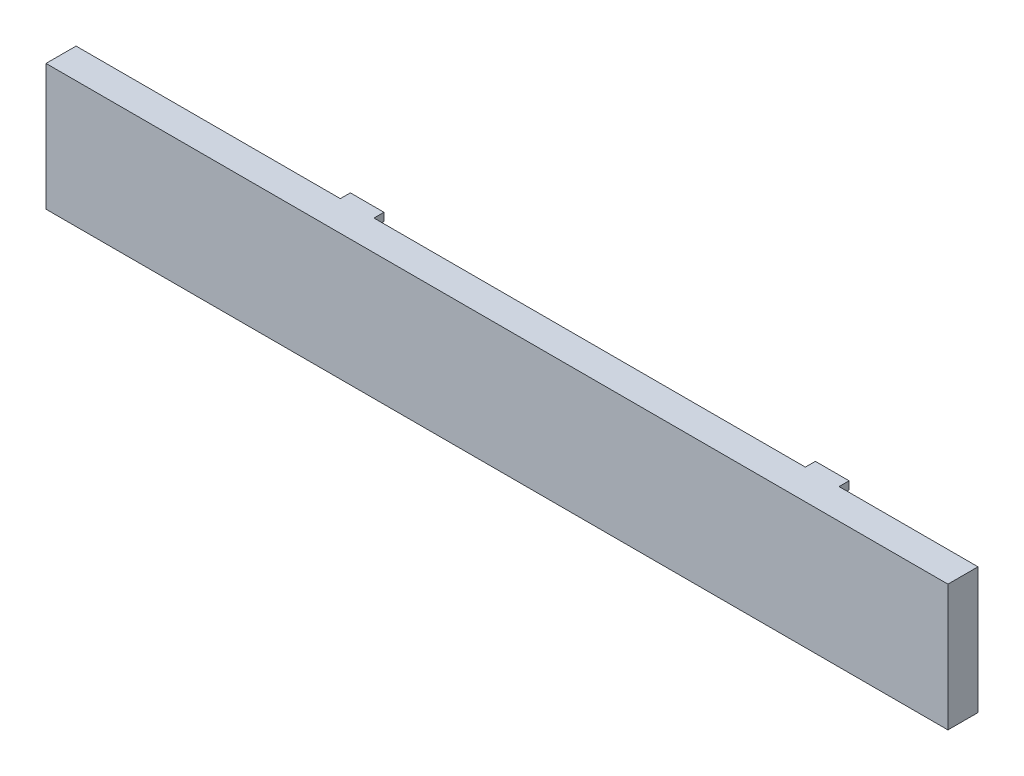
ISO-10303-21;
HEADER;
FILE_DESCRIPTION(('STEP AP214'),'2;1');
FILE_NAME('part.step','',(''),(''),'','','');
FILE_SCHEMA(('AUTOMOTIVE_DESIGN { 1 0 10303 214 1 1 1 1 }'));
ENDSEC;
DATA;
#1=APPLICATION_CONTEXT('core data for automotive mechanical design processes');
#2=APPLICATION_PROTOCOL_DEFINITION('international standard','automotive_design',2000,#1);
#3=PRODUCT_CONTEXT('',#1,'mechanical');
#4=PRODUCT('Part','Part','',(#3));
#5=PRODUCT_RELATED_PRODUCT_CATEGORY('part','',(#4));
#6=PRODUCT_DEFINITION_FORMATION('','',#4);
#7=PRODUCT_DEFINITION_CONTEXT('part definition',#1,'design');
#8=PRODUCT_DEFINITION('design','',#6,#7);
#9=PRODUCT_DEFINITION_SHAPE('','',#8);
#10=(LENGTH_UNIT() NAMED_UNIT(*) SI_UNIT(.MILLI.,.METRE.));
#11=(NAMED_UNIT(*) PLANE_ANGLE_UNIT() SI_UNIT($,.RADIAN.));
#12=(NAMED_UNIT(*) SI_UNIT($,.STERADIAN.) SOLID_ANGLE_UNIT());
#13=UNCERTAINTY_MEASURE_WITH_UNIT(LENGTH_MEASURE(1.E-05),#10,'distance_accuracy_value','');
#14=(GEOMETRIC_REPRESENTATION_CONTEXT(3) GLOBAL_UNCERTAINTY_ASSIGNED_CONTEXT((#13)) GLOBAL_UNIT_ASSIGNED_CONTEXT((#10,
#11,#12)) REPRESENTATION_CONTEXT('',''));
#15=CARTESIAN_POINT('',(0.,0.,0.));
#16=DIRECTION('',(0.,0.,1.));
#17=DIRECTION('',(1.,0.,0.));
#18=AXIS2_PLACEMENT_3D('',#15,#16,#17);
#19=CARTESIAN_POINT('',(0.,0.,0.));
#20=DIRECTION('',(0.,0.,1.));
#21=DIRECTION('',(1.,0.,0.));
#22=AXIS2_PLACEMENT_3D('',#19,#20,#21);
#23=PLANE('',#22);
#24=DIRECTION('',(1.,0.,0.));
#25=VECTOR('',#24,1.);
#26=CARTESIAN_POINT('',(-1271.22015915119,793.432360742705,0.));
#27=LINE('',#26,#25);
#28=CARTESIAN_POINT('',(-1139.37154650016,793.432360742705,0.));
#29=VERTEX_POINT('',#28);
#30=CARTESIAN_POINT('',(-1122.5980626486,793.432360742705,0.));
#31=VERTEX_POINT('',#30);
#32=EDGE_CURVE('E233',#29,#31,#27,.T.);
#33=ORIENTED_EDGE('',*,*,#32,.F.);
#34=DIRECTION('',(0.,-1.,0.));
#35=VECTOR('',#34,1.);
#36=CARTESIAN_POINT('',(-1139.37154650016,856.432360742705,0.));
#37=LINE('',#36,#35);
#38=CARTESIAN_POINT('',(-1139.37154650016,797.432360742705,0.));
#39=VERTEX_POINT('',#38);
#40=EDGE_CURVE('E224',#39,#29,#37,.T.);
#41=ORIENTED_EDGE('',*,*,#40,.F.);
#42=DIRECTION('',(1.,0.,0.));
#43=VECTOR('',#42,1.);
#44=CARTESIAN_POINT('',(0.,797.432360742705,0.));
#45=LINE('',#44,#43);
#46=CARTESIAN_POINT('',(-1122.5980626486,797.432360742705,0.));
#47=VERTEX_POINT('',#46);
#48=EDGE_CURVE('E290',#39,#47,#45,.T.);
#49=ORIENTED_EDGE('',*,*,#48,.T.);
#50=DIRECTION('',(0.,-1.,0.));
#51=VECTOR('',#50,1.);
#52=CARTESIAN_POINT('',(-1122.5980626486,856.432360742705,0.));
#53=LINE('',#52,#51);
#54=EDGE_CURVE('E439',#47,#31,#53,.T.);
#55=ORIENTED_EDGE('',*,*,#54,.T.);
#56=EDGE_LOOP('',(#33,#41,#49,#55));
#57=FACE_BOUND('',#56,.T.);
#58=ADVANCED_FACE('F42',(#57),#23,.F.);
#59=DIRECTION('',(-1.,0.,0.));
#60=VECTOR('',#59,1.);
#61=CARTESIAN_POINT('',(0.,852.432360742705,0.));
#62=LINE('',#61,#60);
#63=CARTESIAN_POINT('',(-1122.5980626486,852.432360742705,0.));
#64=VERTEX_POINT('',#63);
#65=CARTESIAN_POINT('',(-1139.37154650016,852.432360742705,0.));
#66=VERTEX_POINT('',#65);
#67=EDGE_CURVE('E221',#64,#66,#62,.T.);
#68=ORIENTED_EDGE('',*,*,#67,.T.);
#69=CARTESIAN_POINT('',(-1139.37154650016,856.432360742705,0.));
#70=VERTEX_POINT('',#69);
#71=EDGE_CURVE('E58',#70,#66,#37,.T.);
#72=ORIENTED_EDGE('',*,*,#71,.F.);
#73=DIRECTION('',(-1.,0.,0.));
#74=VECTOR('',#73,1.);
#75=CARTESIAN_POINT('',(-1271.22015915119,856.432360742705,0.));
#76=LINE('',#75,#74);
#77=CARTESIAN_POINT('',(-1122.5980626486,856.432360742705,0.));
#78=VERTEX_POINT('',#77);
#79=EDGE_CURVE('E219',#78,#70,#76,.T.);
#80=ORIENTED_EDGE('',*,*,#79,.F.);
#81=EDGE_CURVE('E435',#78,#64,#53,.T.);
#82=ORIENTED_EDGE('',*,*,#81,.T.);
#83=EDGE_LOOP('',(#68,#72,#80,#82));
#84=FACE_BOUND('',#83,.T.);
#85=ADVANCED_FACE('F217',(#84),#23,.F.);
#86=CARTESIAN_POINT('',(-890.544664310097,852.432360742705,0.));
#87=VERTEX_POINT('',#86);
#88=CARTESIAN_POINT('',(-907.360274365427,852.432360742705,0.));
#89=VERTEX_POINT('',#88);
#90=EDGE_CURVE('E305',#87,#89,#62,.T.);
#91=ORIENTED_EDGE('',*,*,#90,.T.);
#92=DIRECTION('',(0.,-1.,0.));
#93=VECTOR('',#92,1.);
#94=CARTESIAN_POINT('',(-907.360274365427,856.432360742705,0.));
#95=LINE('',#94,#93);
#96=CARTESIAN_POINT('',(-907.360274365427,856.432360742705,0.));
#97=VERTEX_POINT('',#96);
#98=EDGE_CURVE('E66',#97,#89,#95,.T.);
#99=ORIENTED_EDGE('',*,*,#98,.F.);
#100=CARTESIAN_POINT('',(-890.544664310097,856.432360742705,0.));
#101=VERTEX_POINT('',#100);
#102=EDGE_CURVE('E232',#101,#97,#76,.T.);
#103=ORIENTED_EDGE('',*,*,#102,.F.);
#104=DIRECTION('',(0.,-1.,0.));
#105=VECTOR('',#104,1.);
#106=CARTESIAN_POINT('',(-890.544664310097,856.432360742705,0.));
#107=LINE('',#106,#105);
#108=EDGE_CURVE('E367',#101,#87,#107,.T.);
#109=ORIENTED_EDGE('',*,*,#108,.T.);
#110=EDGE_LOOP('',(#91,#99,#103,#109));
#111=FACE_BOUND('',#110,.T.);
#112=ADVANCED_FACE('F537',(#111),#23,.F.);
#113=CARTESIAN_POINT('',(-1271.22015915119,856.432360742705,20.));
#114=DIRECTION('',(1.,0.,0.));
#115=DIRECTION('',(0.,1.,0.));
#116=AXIS2_PLACEMENT_3D('',#113,#114,#115);
#117=PLANE('',#116);
#118=DIRECTION('',(0.,0.,-1.));
#119=VECTOR('',#118,1.);
#120=CARTESIAN_POINT('',(-1271.22015915119,856.432360742705,20.));
#121=LINE('',#120,#119);
#122=CARTESIAN_POINT('',(-1271.22015915119,856.432360742705,20.));
#123=VERTEX_POINT('',#122);
#124=CARTESIAN_POINT('',(-1271.22015915119,856.432360742705,5.));
#125=VERTEX_POINT('',#124);
#126=EDGE_CURVE('E244',#123,#125,#121,.T.);
#127=ORIENTED_EDGE('',*,*,#126,.T.);
#128=DIRECTION('',(0.,-1.,0.));
#129=VECTOR('',#128,1.);
#130=CARTESIAN_POINT('',(-1271.22015915119,856.432360742705,5.));
#131=LINE('',#130,#129);
#132=CARTESIAN_POINT('',(-1271.22015915119,852.432360742705,5.));
#133=VERTEX_POINT('',#132);
#134=EDGE_CURVE('E383',#125,#133,#131,.T.);
#135=ORIENTED_EDGE('',*,*,#134,.T.);
#136=DIRECTION('',(0.,0.,-1.));
#137=VECTOR('',#136,1.);
#138=CARTESIAN_POINT('',(-1271.22015915119,852.432360742705,10.));
#139=LINE('',#138,#137);
#140=CARTESIAN_POINT('',(-1271.22015915119,852.432360742705,10.));
#141=VERTEX_POINT('',#140);
#142=EDGE_CURVE('E322',#141,#133,#139,.T.);
#143=ORIENTED_EDGE('',*,*,#142,.F.);
#144=DIRECTION('',(0.,-1.,0.));
#145=VECTOR('',#144,1.);
#146=CARTESIAN_POINT('',(-1271.22015915119,0.,10.));
#147=LINE('',#146,#145);
#148=CARTESIAN_POINT('',(-1271.22015915119,797.432360742705,10.));
#149=VERTEX_POINT('',#148);
#150=EDGE_CURVE('E302',#141,#149,#147,.T.);
#151=ORIENTED_EDGE('',*,*,#150,.T.);
#152=DIRECTION('',(0.,0.,-1.));
#153=VECTOR('',#152,1.);
#154=CARTESIAN_POINT('',(-1271.22015915119,797.432360742705,10.));
#155=LINE('',#154,#153);
#156=CARTESIAN_POINT('',(-1271.22015915119,797.432360742705,5.));
#157=VERTEX_POINT('',#156);
#158=EDGE_CURVE('E318',#149,#157,#155,.T.);
#159=ORIENTED_EDGE('',*,*,#158,.T.);
#160=CARTESIAN_POINT('',(-1271.22015915119,793.432360742705,5.));
#161=VERTEX_POINT('',#160);
#162=EDGE_CURVE('E346',#157,#161,#131,.T.);
#163=ORIENTED_EDGE('',*,*,#162,.T.);
#164=DIRECTION('',(0.,0.,-1.));
#165=VECTOR('',#164,1.);
#166=CARTESIAN_POINT('',(-1271.22015915119,793.432360742705,20.));
#167=LINE('',#166,#165);
#168=CARTESIAN_POINT('',(-1271.22015915119,793.432360742705,20.));
#169=VERTEX_POINT('',#168);
#170=EDGE_CURVE('E257',#169,#161,#167,.T.);
#171=ORIENTED_EDGE('',*,*,#170,.F.);
#172=DIRECTION('',(0.,-1.,0.));
#173=VECTOR('',#172,1.);
#174=CARTESIAN_POINT('',(-1271.22015915119,856.432360742705,20.));
#175=LINE('',#174,#173);
#176=EDGE_CURVE('E238',#123,#169,#175,.T.);
#177=ORIENTED_EDGE('',*,*,#176,.F.);
#178=EDGE_LOOP('',(#127,#135,#143,#151,#159,#163,#171,#177));
#179=FACE_BOUND('',#178,.T.);
#180=ADVANCED_FACE('F44',(#179),#117,.F.);
#181=CARTESIAN_POINT('',(-907.360274365427,793.432360742705,0.));
#182=VERTEX_POINT('',#181);
#183=CARTESIAN_POINT('',(-890.544664310097,793.432360742705,0.));
#184=VERTEX_POINT('',#183);
#185=EDGE_CURVE('E240',#182,#184,#27,.T.);
#186=ORIENTED_EDGE('',*,*,#185,.F.);
#187=CARTESIAN_POINT('',(-907.360274365427,797.432360742705,0.));
#188=VERTEX_POINT('',#187);
#189=EDGE_CURVE('E442',#188,#182,#95,.T.);
#190=ORIENTED_EDGE('',*,*,#189,.F.);
#191=CARTESIAN_POINT('',(-890.544664310097,797.432360742705,0.));
#192=VERTEX_POINT('',#191);
#193=EDGE_CURVE('E297',#188,#192,#45,.T.);
#194=ORIENTED_EDGE('',*,*,#193,.T.);
#195=EDGE_CURVE('E373',#192,#184,#107,.T.);
#196=ORIENTED_EDGE('',*,*,#195,.T.);
#197=EDGE_LOOP('',(#186,#190,#194,#196));
#198=FACE_BOUND('',#197,.T.);
#199=ADVANCED_FACE('F509',(#198),#23,.F.);
#200=CARTESIAN_POINT('',(-1271.22015915119,793.432360742705,20.));
#201=DIRECTION('',(0.,1.,0.));
#202=DIRECTION('',(0.,0.,1.));
#203=AXIS2_PLACEMENT_3D('',#200,#201,#202);
#204=PLANE('',#203);
#205=ORIENTED_EDGE('',*,*,#170,.T.);
#206=DIRECTION('',(-1.,0.,0.));
#207=VECTOR('',#206,1.);
#208=CARTESIAN_POINT('',(-1271.22015915119,793.432360742705,5.));
#209=LINE('',#208,#207);
#210=CARTESIAN_POINT('',(-1139.37154650016,793.432360742705,5.));
#211=VERTEX_POINT('',#210);
#212=EDGE_CURVE('E212',#211,#161,#209,.T.);
#213=ORIENTED_EDGE('',*,*,#212,.F.);
#214=DIRECTION('',(0.,0.,1.));
#215=VECTOR('',#214,1.);
#216=CARTESIAN_POINT('',(-1139.37154650016,793.432360742705,5.));
#217=LINE('',#216,#215);
#218=EDGE_CURVE('E464',#29,#211,#217,.T.);
#219=ORIENTED_EDGE('',*,*,#218,.F.);
#220=ORIENTED_EDGE('',*,*,#32,.T.);
#221=DIRECTION('',(0.,0.,-1.));
#222=VECTOR('',#221,1.);
#223=CARTESIAN_POINT('',(-1122.5980626486,793.432360742705,5.));
#224=LINE('',#223,#222);
#225=CARTESIAN_POINT('',(-1122.5980626486,793.432360742705,5.));
#226=VERTEX_POINT('',#225);
#227=EDGE_CURVE('E461',#226,#31,#224,.T.);
#228=ORIENTED_EDGE('',*,*,#227,.F.);
#229=DIRECTION('',(-1.,0.,0.));
#230=VECTOR('',#229,1.);
#231=CARTESIAN_POINT('',(-1122.5980626486,793.432360742705,5.));
#232=LINE('',#231,#230);
#233=CARTESIAN_POINT('',(-907.360274365427,793.432360742705,5.));
#234=VERTEX_POINT('',#233);
#235=EDGE_CURVE('E453',#234,#226,#232,.T.);
#236=ORIENTED_EDGE('',*,*,#235,.F.);
#237=DIRECTION('',(0.,0.,1.));
#238=VECTOR('',#237,1.);
#239=CARTESIAN_POINT('',(-907.360274365427,793.432360742705,5.));
#240=LINE('',#239,#238);
#241=EDGE_CURVE('E457',#182,#234,#240,.T.);
#242=ORIENTED_EDGE('',*,*,#241,.F.);
#243=ORIENTED_EDGE('',*,*,#185,.T.);
#244=DIRECTION('',(0.,0.,-1.));
#245=VECTOR('',#244,1.);
#246=CARTESIAN_POINT('',(-890.544664310097,793.432360742705,5.));
#247=LINE('',#246,#245);
#248=CARTESIAN_POINT('',(-890.544664310097,793.432360742705,5.));
#249=VERTEX_POINT('',#248);
#250=EDGE_CURVE('E376',#249,#184,#247,.T.);
#251=ORIENTED_EDGE('',*,*,#250,.F.);
#252=DIRECTION('',(-1.,0.,0.));
#253=VECTOR('',#252,1.);
#254=CARTESIAN_POINT('',(-890.544664310097,793.432360742705,5.));
#255=LINE('',#254,#253);
#256=CARTESIAN_POINT('',(-821.220159151194,793.432360742705,5.));
#257=VERTEX_POINT('',#256);
#258=EDGE_CURVE('E354',#257,#249,#255,.T.);
#259=ORIENTED_EDGE('',*,*,#258,.F.);
#260=DIRECTION('',(0.,0.,-1.));
#261=VECTOR('',#260,1.);
#262=CARTESIAN_POINT('',(-821.220159151194,793.432360742705,20.));
#263=LINE('',#262,#261);
#264=CARTESIAN_POINT('',(-821.220159151194,793.432360742705,20.));
#265=VERTEX_POINT('',#264);
#266=EDGE_CURVE('E253',#265,#257,#263,.T.);
#267=ORIENTED_EDGE('',*,*,#266,.F.);
#268=DIRECTION('',(1.,0.,0.));
#269=VECTOR('',#268,1.);
#270=CARTESIAN_POINT('',(-1271.22015915119,793.432360742705,20.));
#271=LINE('',#270,#269);
#272=EDGE_CURVE('E329',#169,#265,#271,.T.);
#273=ORIENTED_EDGE('',*,*,#272,.F.);
#274=EDGE_LOOP('',(#205,#213,#219,#220,#228,#236,#242,#243,#251,#259,#267,#273));
#275=FACE_BOUND('',#274,.T.);
#276=ADVANCED_FACE('F349',(#275),#204,.F.);
#277=CARTESIAN_POINT('',(-821.220159151194,856.432360742705,20.));
#278=DIRECTION('',(-1.,0.,0.));
#279=DIRECTION('',(0.,-1.,0.));
#280=AXIS2_PLACEMENT_3D('',#277,#278,#279);
#281=PLANE('',#280);
#282=ORIENTED_EDGE('',*,*,#266,.T.);
#283=DIRECTION('',(0.,-1.,0.));
#284=VECTOR('',#283,1.);
#285=CARTESIAN_POINT('',(-821.220159151194,856.432360742705,5.));
#286=LINE('',#285,#284);
#287=CARTESIAN_POINT('',(-821.220159151194,856.432360742705,5.));
#288=VERTEX_POINT('',#287);
#289=EDGE_CURVE('E358',#288,#257,#286,.T.);
#290=ORIENTED_EDGE('',*,*,#289,.F.);
#291=DIRECTION('',(0.,0.,-1.));
#292=VECTOR('',#291,1.);
#293=CARTESIAN_POINT('',(-821.220159151194,856.432360742705,20.));
#294=LINE('',#293,#292);
#295=CARTESIAN_POINT('',(-821.220159151194,856.432360742705,20.));
#296=VERTEX_POINT('',#295);
#297=EDGE_CURVE('E248',#296,#288,#294,.T.);
#298=ORIENTED_EDGE('',*,*,#297,.F.);
#299=DIRECTION('',(0.,1.,0.));
#300=VECTOR('',#299,1.);
#301=CARTESIAN_POINT('',(-821.220159151194,856.432360742705,20.));
#302=LINE('',#301,#300);
#303=EDGE_CURVE('E332',#265,#296,#302,.T.);
#304=ORIENTED_EDGE('',*,*,#303,.F.);
#305=EDGE_LOOP('',(#282,#290,#298,#304));
#306=FACE_BOUND('',#305,.T.);
#307=ADVANCED_FACE('F357',(#306),#281,.F.);
#308=CARTESIAN_POINT('',(-1271.22015915119,856.432360742705,20.));
#309=DIRECTION('',(0.,-1.,0.));
#310=DIRECTION('',(0.,0.,-1.));
#311=AXIS2_PLACEMENT_3D('',#308,#309,#310);
#312=PLANE('',#311);
#313=DIRECTION('',(0.,0.,1.));
#314=VECTOR('',#313,1.);
#315=CARTESIAN_POINT('',(-1139.37154650016,856.432360742705,5.));
#316=LINE('',#315,#314);
#317=CARTESIAN_POINT('',(-1139.37154650016,856.432360742705,5.));
#318=VERTEX_POINT('',#317);
#319=EDGE_CURVE('E202',#70,#318,#316,.T.);
#320=ORIENTED_EDGE('',*,*,#319,.T.);
#321=DIRECTION('',(-1.,0.,0.));
#322=VECTOR('',#321,1.);
#323=CARTESIAN_POINT('',(-1271.22015915119,856.432360742705,5.));
#324=LINE('',#323,#322);
#325=EDGE_CURVE('E211',#318,#125,#324,.T.);
#326=ORIENTED_EDGE('',*,*,#325,.T.);
#327=ORIENTED_EDGE('',*,*,#126,.F.);
#328=DIRECTION('',(-1.,0.,0.));
#329=VECTOR('',#328,1.);
#330=CARTESIAN_POINT('',(-1271.22015915119,856.432360742705,20.));
#331=LINE('',#330,#329);
#332=EDGE_CURVE('E249',#296,#123,#331,.T.);
#333=ORIENTED_EDGE('',*,*,#332,.F.);
#334=ORIENTED_EDGE('',*,*,#297,.T.);
#335=DIRECTION('',(-1.,0.,0.));
#336=VECTOR('',#335,1.);
#337=CARTESIAN_POINT('',(-890.544664310097,856.432360742705,5.));
#338=LINE('',#337,#336);
#339=CARTESIAN_POINT('',(-890.544664310097,856.432360742705,5.));
#340=VERTEX_POINT('',#339);
#341=EDGE_CURVE('E361',#288,#340,#338,.T.);
#342=ORIENTED_EDGE('',*,*,#341,.T.);
#343=DIRECTION('',(0.,0.,-1.));
#344=VECTOR('',#343,1.);
#345=CARTESIAN_POINT('',(-890.544664310097,856.432360742705,5.));
#346=LINE('',#345,#344);
#347=EDGE_CURVE('E363',#340,#101,#346,.T.);
#348=ORIENTED_EDGE('',*,*,#347,.T.);
#349=ORIENTED_EDGE('',*,*,#102,.T.);
#350=DIRECTION('',(0.,0.,1.));
#351=VECTOR('',#350,1.);
#352=CARTESIAN_POINT('',(-907.360274365427,856.432360742705,5.));
#353=LINE('',#352,#351);
#354=CARTESIAN_POINT('',(-907.360274365427,856.432360742705,5.));
#355=VERTEX_POINT('',#354);
#356=EDGE_CURVE('E467',#97,#355,#353,.T.);
#357=ORIENTED_EDGE('',*,*,#356,.T.);
#358=DIRECTION('',(-1.,0.,0.));
#359=VECTOR('',#358,1.);
#360=CARTESIAN_POINT('',(-1122.5980626486,856.432360742705,5.));
#361=LINE('',#360,#359);
#362=CARTESIAN_POINT('',(-1122.5980626486,856.432360742705,5.));
#363=VERTEX_POINT('',#362);
#364=EDGE_CURVE('E438',#355,#363,#361,.T.);
#365=ORIENTED_EDGE('',*,*,#364,.T.);
#366=DIRECTION('',(0.,0.,-1.));
#367=VECTOR('',#366,1.);
#368=CARTESIAN_POINT('',(-1122.5980626486,856.432360742705,5.));
#369=LINE('',#368,#367);
#370=EDGE_CURVE('E230',#363,#78,#369,.T.);
#371=ORIENTED_EDGE('',*,*,#370,.T.);
#372=ORIENTED_EDGE('',*,*,#79,.T.);
#373=EDGE_LOOP('',(#320,#326,#327,#333,#334,#342,#348,#349,#357,#365,#371,#372));
#374=FACE_BOUND('',#373,.T.);
#375=ADVANCED_FACE('F227',(#374),#312,.F.);
#376=CARTESIAN_POINT('',(0.,0.,20.));
#377=DIRECTION('',(0.,0.,1.));
#378=DIRECTION('',(1.,0.,0.));
#379=AXIS2_PLACEMENT_3D('',#376,#377,#378);
#380=PLANE('',#379);
#381=ORIENTED_EDGE('',*,*,#176,.T.);
#382=ORIENTED_EDGE('',*,*,#272,.T.);
#383=ORIENTED_EDGE('',*,*,#303,.T.);
#384=ORIENTED_EDGE('',*,*,#332,.T.);
#385=EDGE_LOOP('',(#381,#382,#383,#384));
#386=FACE_BOUND('',#385,.T.);
#387=ADVANCED_FACE('F338',(#386),#380,.T.);
#388=CARTESIAN_POINT('',(0.,852.432360742705,10.));
#389=DIRECTION('',(0.,-1.,0.));
#390=DIRECTION('',(0.,0.,-1.));
#391=AXIS2_PLACEMENT_3D('',#388,#389,#390);
#392=PLANE('',#391);
#393=DIRECTION('',(-1.,0.,0.));
#394=VECTOR('',#393,1.);
#395=CARTESIAN_POINT('',(0.,852.432360742705,4.99999999999999));
#396=LINE('',#395,#394);
#397=CARTESIAN_POINT('',(-1139.37154650016,852.432360742705,5.));
#398=VERTEX_POINT('',#397);
#399=EDGE_CURVE('E401',#398,#133,#396,.T.);
#400=ORIENTED_EDGE('',*,*,#399,.F.);
#401=DIRECTION('',(0.,0.,1.));
#402=VECTOR('',#401,1.);
#403=CARTESIAN_POINT('',(-1139.37154650016,852.432360742705,10.));
#404=LINE('',#403,#402);
#405=EDGE_CURVE('E398',#66,#398,#404,.T.);
#406=ORIENTED_EDGE('',*,*,#405,.F.);
#407=ORIENTED_EDGE('',*,*,#67,.F.);
#408=DIRECTION('',(0.,0.,-1.));
#409=VECTOR('',#408,1.);
#410=CARTESIAN_POINT('',(-1122.5980626486,852.432360742705,10.));
#411=LINE('',#410,#409);
#412=CARTESIAN_POINT('',(-1122.5980626486,852.432360742705,5.));
#413=VERTEX_POINT('',#412);
#414=EDGE_CURVE('E395',#413,#64,#411,.T.);
#415=ORIENTED_EDGE('',*,*,#414,.F.);
#416=DIRECTION('',(-1.,0.,0.));
#417=VECTOR('',#416,1.);
#418=CARTESIAN_POINT('',(0.,852.432360742705,5.));
#419=LINE('',#418,#417);
#420=CARTESIAN_POINT('',(-907.360274365427,852.432360742705,5.));
#421=VERTEX_POINT('',#420);
#422=EDGE_CURVE('E392',#421,#413,#419,.T.);
#423=ORIENTED_EDGE('',*,*,#422,.F.);
#424=DIRECTION('',(0.,0.,1.));
#425=VECTOR('',#424,1.);
#426=CARTESIAN_POINT('',(-907.360274365427,852.432360742705,10.));
#427=LINE('',#426,#425);
#428=EDGE_CURVE('E389',#89,#421,#427,.T.);
#429=ORIENTED_EDGE('',*,*,#428,.F.);
#430=ORIENTED_EDGE('',*,*,#90,.F.);
#431=DIRECTION('',(0.,0.,-1.));
#432=VECTOR('',#431,1.);
#433=CARTESIAN_POINT('',(-890.544664310097,852.432360742705,10.));
#434=LINE('',#433,#432);
#435=CARTESIAN_POINT('',(-890.544664310097,852.432360742705,5.));
#436=VERTEX_POINT('',#435);
#437=EDGE_CURVE('E386',#436,#87,#434,.T.);
#438=ORIENTED_EDGE('',*,*,#437,.F.);
#439=DIRECTION('',(-1.,0.,0.));
#440=VECTOR('',#439,1.);
#441=CARTESIAN_POINT('',(0.,852.432360742705,5.));
#442=LINE('',#441,#440);
#443=CARTESIAN_POINT('',(-826.220159151194,852.432360742705,5.));
#444=VERTEX_POINT('',#443);
#445=EDGE_CURVE('E382',#444,#436,#442,.T.);
#446=ORIENTED_EDGE('',*,*,#445,.F.);
#447=DIRECTION('',(0.,0.,-1.));
#448=VECTOR('',#447,1.);
#449=CARTESIAN_POINT('',(-826.220159151194,852.432360742705,10.));
#450=LINE('',#449,#448);
#451=CARTESIAN_POINT('',(-826.220159151194,852.432360742705,10.));
#452=VERTEX_POINT('',#451);
#453=EDGE_CURVE('E309',#452,#444,#450,.T.);
#454=ORIENTED_EDGE('',*,*,#453,.F.);
#455=DIRECTION('',(-1.,0.,0.));
#456=VECTOR('',#455,1.);
#457=CARTESIAN_POINT('',(0.,852.432360742705,10.));
#458=LINE('',#457,#456);
#459=EDGE_CURVE('E296',#452,#141,#458,.T.);
#460=ORIENTED_EDGE('',*,*,#459,.T.);
#461=ORIENTED_EDGE('',*,*,#142,.T.);
#462=EDGE_LOOP('',(#400,#406,#407,#415,#423,#429,#430,#438,#446,#454,#460,#461));
#463=FACE_BOUND('',#462,.T.);
#464=ADVANCED_FACE('F422',(#463),#392,.T.);
#465=CARTESIAN_POINT('',(0.,797.432360742705,10.));
#466=DIRECTION('',(0.,1.,0.));
#467=DIRECTION('',(0.,0.,1.));
#468=AXIS2_PLACEMENT_3D('',#465,#466,#467);
#469=PLANE('',#468);
#470=DIRECTION('',(1.,0.,0.));
#471=VECTOR('',#470,1.);
#472=CARTESIAN_POINT('',(0.,797.432360742705,4.99999999999999));
#473=LINE('',#472,#471);
#474=CARTESIAN_POINT('',(-1139.37154650016,797.432360742705,5.));
#475=VERTEX_POINT('',#474);
#476=EDGE_CURVE('E11',#157,#475,#473,.T.);
#477=ORIENTED_EDGE('',*,*,#476,.F.);
#478=ORIENTED_EDGE('',*,*,#158,.F.);
#479=DIRECTION('',(1.,0.,0.));
#480=VECTOR('',#479,1.);
#481=CARTESIAN_POINT('',(0.,797.432360742705,10.));
#482=LINE('',#481,#480);
#483=CARTESIAN_POINT('',(-826.220159151194,797.432360742705,10.));
#484=VERTEX_POINT('',#483);
#485=EDGE_CURVE('E407',#149,#484,#482,.T.);
#486=ORIENTED_EDGE('',*,*,#485,.T.);
#487=DIRECTION('',(0.,0.,-1.));
#488=VECTOR('',#487,1.);
#489=CARTESIAN_POINT('',(-826.220159151194,797.432360742705,10.));
#490=LINE('',#489,#488);
#491=CARTESIAN_POINT('',(-826.220159151194,797.432360742705,5.));
#492=VERTEX_POINT('',#491);
#493=EDGE_CURVE('E313',#484,#492,#490,.T.);
#494=ORIENTED_EDGE('',*,*,#493,.T.);
#495=DIRECTION('',(1.,0.,0.));
#496=VECTOR('',#495,1.);
#497=CARTESIAN_POINT('',(0.,797.432360742705,5.));
#498=LINE('',#497,#496);
#499=CARTESIAN_POINT('',(-890.544664310097,797.432360742705,5.));
#500=VERTEX_POINT('',#499);
#501=EDGE_CURVE('E379',#500,#492,#498,.T.);
#502=ORIENTED_EDGE('',*,*,#501,.F.);
#503=DIRECTION('',(0.,0.,1.));
#504=VECTOR('',#503,1.);
#505=CARTESIAN_POINT('',(-890.544664310097,797.432360742705,10.));
#506=LINE('',#505,#504);
#507=EDGE_CURVE('E264',#192,#500,#506,.T.);
#508=ORIENTED_EDGE('',*,*,#507,.F.);
#509=ORIENTED_EDGE('',*,*,#193,.F.);
#510=DIRECTION('',(0.,0.,-1.));
#511=VECTOR('',#510,1.);
#512=CARTESIAN_POINT('',(-907.360274365427,797.432360742705,10.));
#513=LINE('',#512,#511);
#514=CARTESIAN_POINT('',(-907.360274365427,797.432360742705,5.));
#515=VERTEX_POINT('',#514);
#516=EDGE_CURVE('E267',#515,#188,#513,.T.);
#517=ORIENTED_EDGE('',*,*,#516,.F.);
#518=DIRECTION('',(1.,0.,0.));
#519=VECTOR('',#518,1.);
#520=CARTESIAN_POINT('',(0.,797.432360742705,5.));
#521=LINE('',#520,#519);
#522=CARTESIAN_POINT('',(-1122.5980626486,797.432360742705,5.));
#523=VERTEX_POINT('',#522);
#524=EDGE_CURVE('E270',#523,#515,#521,.T.);
#525=ORIENTED_EDGE('',*,*,#524,.F.);
#526=DIRECTION('',(0.,0.,1.));
#527=VECTOR('',#526,1.);
#528=CARTESIAN_POINT('',(-1122.5980626486,797.432360742705,10.));
#529=LINE('',#528,#527);
#530=EDGE_CURVE('E274',#47,#523,#529,.T.);
#531=ORIENTED_EDGE('',*,*,#530,.F.);
#532=ORIENTED_EDGE('',*,*,#48,.F.);
#533=DIRECTION('',(0.,0.,-1.));
#534=VECTOR('',#533,1.);
#535=CARTESIAN_POINT('',(-1139.37154650016,797.432360742705,10.));
#536=LINE('',#535,#534);
#537=EDGE_CURVE('E51',#475,#39,#536,.T.);
#538=ORIENTED_EDGE('',*,*,#537,.F.);
#539=EDGE_LOOP('',(#477,#478,#486,#494,#502,#508,#509,#517,#525,#531,#532,#538));
#540=FACE_BOUND('',#539,.T.);
#541=ADVANCED_FACE('F293',(#540),#469,.T.);
#542=CARTESIAN_POINT('',(-826.220159151194,0.,10.));
#543=DIRECTION('',(-1.,0.,0.));
#544=DIRECTION('',(0.,0.,1.));
#545=AXIS2_PLACEMENT_3D('',#542,#543,#544);
#546=PLANE('',#545);
#547=DIRECTION('',(0.,1.,0.));
#548=VECTOR('',#547,1.);
#549=CARTESIAN_POINT('',(-826.220159151194,0.,5.));
#550=LINE('',#549,#548);
#551=EDGE_CURVE('E261',#492,#444,#550,.T.);
#552=ORIENTED_EDGE('',*,*,#551,.F.);
#553=ORIENTED_EDGE('',*,*,#493,.F.);
#554=DIRECTION('',(0.,1.,0.));
#555=VECTOR('',#554,1.);
#556=CARTESIAN_POINT('',(-826.220159151194,0.,10.));
#557=LINE('',#556,#555);
#558=EDGE_CURVE('E314',#484,#452,#557,.T.);
#559=ORIENTED_EDGE('',*,*,#558,.T.);
#560=ORIENTED_EDGE('',*,*,#453,.T.);
#561=EDGE_LOOP('',(#552,#553,#559,#560));
#562=FACE_BOUND('',#561,.T.);
#563=ADVANCED_FACE('F415',(#562),#546,.T.);
#564=CARTESIAN_POINT('',(0.,0.,10.));
#565=DIRECTION('',(0.,0.,1.));
#566=DIRECTION('',(1.,0.,0.));
#567=AXIS2_PLACEMENT_3D('',#564,#565,#566);
#568=PLANE('',#567);
#569=ORIENTED_EDGE('',*,*,#459,.F.);
#570=ORIENTED_EDGE('',*,*,#558,.F.);
#571=ORIENTED_EDGE('',*,*,#485,.F.);
#572=ORIENTED_EDGE('',*,*,#150,.F.);
#573=EDGE_LOOP('',(#569,#570,#571,#572));
#574=FACE_BOUND('',#573,.T.);
#575=ADVANCED_FACE('F425',(#574),#568,.F.);
#576=CARTESIAN_POINT('',(-890.544664310097,856.432360742705,5.));
#577=DIRECTION('',(-1.,0.,0.));
#578=DIRECTION('',(0.,0.,1.));
#579=AXIS2_PLACEMENT_3D('',#576,#577,#578);
#580=PLANE('',#579);
#581=ORIENTED_EDGE('',*,*,#437,.T.);
#582=ORIENTED_EDGE('',*,*,#108,.F.);
#583=ORIENTED_EDGE('',*,*,#347,.F.);
#584=DIRECTION('',(0.,-1.,0.));
#585=VECTOR('',#584,1.);
#586=CARTESIAN_POINT('',(-890.544664310097,856.432360742705,5.));
#587=LINE('',#586,#585);
#588=EDGE_CURVE('E475',#340,#436,#587,.T.);
#589=ORIENTED_EDGE('',*,*,#588,.T.);
#590=EDGE_LOOP('',(#581,#582,#583,#589));
#591=FACE_BOUND('',#590,.T.);
#592=ADVANCED_FACE('F638',(#591),#580,.F.);
#593=ORIENTED_EDGE('',*,*,#507,.T.);
#594=EDGE_CURVE('E478',#500,#249,#587,.T.);
#595=ORIENTED_EDGE('',*,*,#594,.T.);
#596=ORIENTED_EDGE('',*,*,#250,.T.);
#597=ORIENTED_EDGE('',*,*,#195,.F.);
#598=EDGE_LOOP('',(#593,#595,#596,#597));
#599=FACE_BOUND('',#598,.T.);
#600=ADVANCED_FACE('F527',(#599),#580,.F.);
#601=CARTESIAN_POINT('',(-890.544664310097,856.432360742705,5.));
#602=DIRECTION('',(0.,0.,1.));
#603=DIRECTION('',(1.,0.,0.));
#604=AXIS2_PLACEMENT_3D('',#601,#602,#603);
#605=PLANE('',#604);
#606=ORIENTED_EDGE('',*,*,#445,.T.);
#607=ORIENTED_EDGE('',*,*,#588,.F.);
#608=ORIENTED_EDGE('',*,*,#341,.F.);
#609=ORIENTED_EDGE('',*,*,#289,.T.);
#610=ORIENTED_EDGE('',*,*,#258,.T.);
#611=ORIENTED_EDGE('',*,*,#594,.F.);
#612=ORIENTED_EDGE('',*,*,#501,.T.);
#613=ORIENTED_EDGE('',*,*,#551,.T.);
#614=EDGE_LOOP('',(#606,#607,#608,#609,#610,#611,#612,#613));
#615=FACE_BOUND('',#614,.T.);
#616=ADVANCED_FACE('F503',(#615),#605,.F.);
#617=CARTESIAN_POINT('',(-907.360274365427,856.432360742705,5.));
#618=DIRECTION('',(1.,0.,0.));
#619=DIRECTION('',(0.,0.,-1.));
#620=AXIS2_PLACEMENT_3D('',#617,#618,#619);
#621=PLANE('',#620);
#622=ORIENTED_EDGE('',*,*,#516,.T.);
#623=ORIENTED_EDGE('',*,*,#189,.T.);
#624=ORIENTED_EDGE('',*,*,#241,.T.);
#625=DIRECTION('',(0.,-1.,0.));
#626=VECTOR('',#625,1.);
#627=CARTESIAN_POINT('',(-907.360274365427,856.432360742705,5.));
#628=LINE('',#627,#626);
#629=EDGE_CURVE('E447',#515,#234,#628,.T.);
#630=ORIENTED_EDGE('',*,*,#629,.F.);
#631=EDGE_LOOP('',(#622,#623,#624,#630));
#632=FACE_BOUND('',#631,.T.);
#633=ADVANCED_FACE('F513',(#632),#621,.F.);
#634=CARTESIAN_POINT('',(-1122.5980626486,856.432360742705,5.));
#635=DIRECTION('',(0.,0.,1.));
#636=DIRECTION('',(1.,0.,0.));
#637=AXIS2_PLACEMENT_3D('',#634,#635,#636);
#638=PLANE('',#637);
#639=ORIENTED_EDGE('',*,*,#524,.T.);
#640=ORIENTED_EDGE('',*,*,#629,.T.);
#641=ORIENTED_EDGE('',*,*,#235,.T.);
#642=DIRECTION('',(0.,-1.,0.));
#643=VECTOR('',#642,1.);
#644=CARTESIAN_POINT('',(-1122.5980626486,856.432360742705,5.));
#645=LINE('',#644,#643);
#646=EDGE_CURVE('E452',#523,#226,#645,.T.);
#647=ORIENTED_EDGE('',*,*,#646,.F.);
#648=EDGE_LOOP('',(#639,#640,#641,#647));
#649=FACE_BOUND('',#648,.T.);
#650=ADVANCED_FACE('F491',(#649),#638,.F.);
#651=CARTESIAN_POINT('',(-1122.5980626486,856.432360742705,5.));
#652=DIRECTION('',(-1.,0.,0.));
#653=DIRECTION('',(0.,0.,1.));
#654=AXIS2_PLACEMENT_3D('',#651,#652,#653);
#655=PLANE('',#654);
#656=ORIENTED_EDGE('',*,*,#530,.T.);
#657=ORIENTED_EDGE('',*,*,#646,.T.);
#658=ORIENTED_EDGE('',*,*,#227,.T.);
#659=ORIENTED_EDGE('',*,*,#54,.F.);
#660=EDGE_LOOP('',(#656,#657,#658,#659));
#661=FACE_BOUND('',#660,.T.);
#662=ADVANCED_FACE('F487',(#661),#655,.F.);
#663=CARTESIAN_POINT('',(-1139.37154650016,856.432360742705,5.));
#664=DIRECTION('',(1.,0.,0.));
#665=DIRECTION('',(0.,0.,-1.));
#666=AXIS2_PLACEMENT_3D('',#663,#664,#665);
#667=PLANE('',#666);
#668=ORIENTED_EDGE('',*,*,#537,.T.);
#669=ORIENTED_EDGE('',*,*,#40,.T.);
#670=ORIENTED_EDGE('',*,*,#218,.T.);
#671=DIRECTION('',(0.,-1.,0.));
#672=VECTOR('',#671,1.);
#673=CARTESIAN_POINT('',(-1139.37154650016,856.432360742705,5.));
#674=LINE('',#673,#672);
#675=EDGE_CURVE('E223',#475,#211,#674,.T.);
#676=ORIENTED_EDGE('',*,*,#675,.F.);
#677=EDGE_LOOP('',(#668,#669,#670,#676));
#678=FACE_BOUND('',#677,.T.);
#679=ADVANCED_FACE('F280',(#678),#667,.F.);
#680=CARTESIAN_POINT('',(-1271.22015915119,856.432360742705,5.));
#681=DIRECTION('',(0.,0.,1.));
#682=DIRECTION('',(1.,0.,0.));
#683=AXIS2_PLACEMENT_3D('',#680,#681,#682);
#684=PLANE('',#683);
#685=ORIENTED_EDGE('',*,*,#476,.T.);
#686=ORIENTED_EDGE('',*,*,#675,.T.);
#687=ORIENTED_EDGE('',*,*,#212,.T.);
#688=ORIENTED_EDGE('',*,*,#162,.F.);
#689=EDGE_LOOP('',(#685,#686,#687,#688));
#690=FACE_BOUND('',#689,.T.);
#691=ADVANCED_FACE('F499',(#690),#684,.F.);
#692=ORIENTED_EDGE('',*,*,#414,.T.);
#693=ORIENTED_EDGE('',*,*,#81,.F.);
#694=ORIENTED_EDGE('',*,*,#370,.F.);
#695=EDGE_CURVE('E448',#363,#413,#645,.T.);
#696=ORIENTED_EDGE('',*,*,#695,.T.);
#697=EDGE_LOOP('',(#692,#693,#694,#696));
#698=FACE_BOUND('',#697,.T.);
#699=ADVANCED_FACE('F559',(#698),#655,.F.);
#700=ORIENTED_EDGE('',*,*,#422,.T.);
#701=ORIENTED_EDGE('',*,*,#695,.F.);
#702=ORIENTED_EDGE('',*,*,#364,.F.);
#703=EDGE_CURVE('E443',#355,#421,#628,.T.);
#704=ORIENTED_EDGE('',*,*,#703,.T.);
#705=EDGE_LOOP('',(#700,#701,#702,#704));
#706=FACE_BOUND('',#705,.T.);
#707=ADVANCED_FACE('F526',(#706),#638,.F.);
#708=ORIENTED_EDGE('',*,*,#428,.T.);
#709=ORIENTED_EDGE('',*,*,#703,.F.);
#710=ORIENTED_EDGE('',*,*,#356,.F.);
#711=ORIENTED_EDGE('',*,*,#98,.T.);
#712=EDGE_LOOP('',(#708,#709,#710,#711));
#713=FACE_BOUND('',#712,.T.);
#714=ADVANCED_FACE('F520',(#713),#621,.F.);
#715=ORIENTED_EDGE('',*,*,#399,.T.);
#716=ORIENTED_EDGE('',*,*,#134,.F.);
#717=ORIENTED_EDGE('',*,*,#325,.F.);
#718=EDGE_CURVE('E205',#318,#398,#674,.T.);
#719=ORIENTED_EDGE('',*,*,#718,.T.);
#720=EDGE_LOOP('',(#715,#716,#717,#719));
#721=FACE_BOUND('',#720,.T.);
#722=ADVANCED_FACE('F427',(#721),#684,.F.);
#723=ORIENTED_EDGE('',*,*,#405,.T.);
#724=ORIENTED_EDGE('',*,*,#718,.F.);
#725=ORIENTED_EDGE('',*,*,#319,.F.);
#726=ORIENTED_EDGE('',*,*,#71,.T.);
#727=EDGE_LOOP('',(#723,#724,#725,#726));
#728=FACE_BOUND('',#727,.T.);
#729=ADVANCED_FACE('F203',(#728),#667,.F.);
#730=CLOSED_SHELL('',(#58,#85,#112,#180,#199,#276,#307,#375,#387,#464,#541,#563,#575,#592,#600,
#616,#633,#650,#662,#679,#691,#699,#707,#714,#722,#729));
#731=MANIFOLD_SOLID_BREP('B2',#730);
#732=ADVANCED_BREP_SHAPE_REPRESENTATION('',(#18,#731),#14);
#733=SHAPE_DEFINITION_REPRESENTATION(#9,#732);
ENDSEC;
END-ISO-10303-21;
